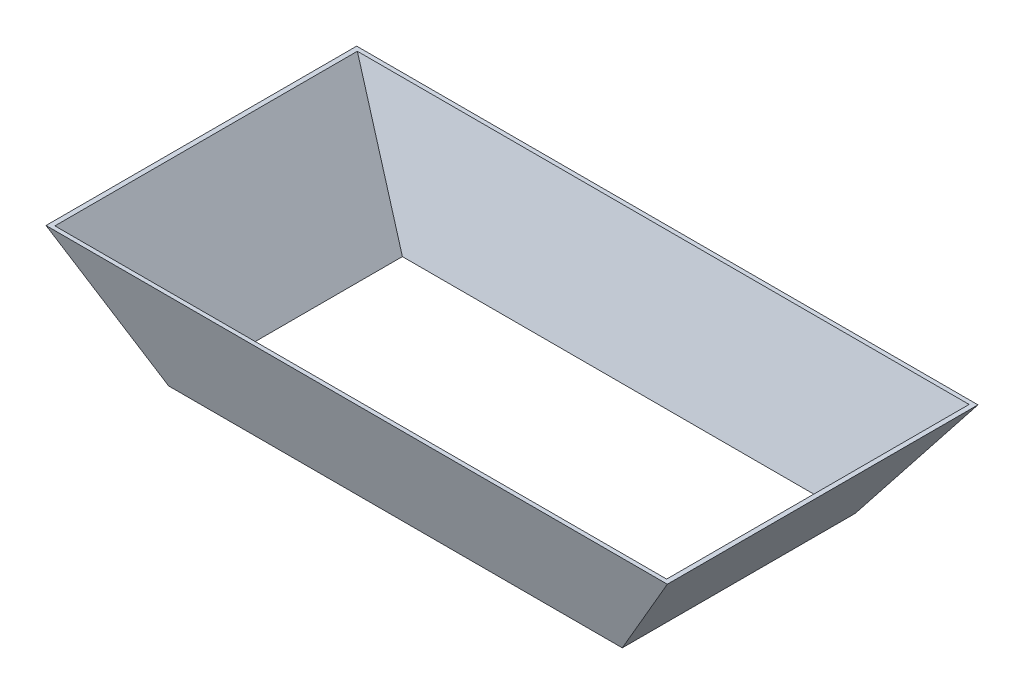
ISO-10303-21;
HEADER;
FILE_DESCRIPTION(('STEP AP214'),'2;1');
FILE_NAME('part.step','',(''),(''),'','','');
FILE_SCHEMA(('AUTOMOTIVE_DESIGN { 1 0 10303 214 1 1 1 1 }'));
ENDSEC;
DATA;
#1=APPLICATION_CONTEXT('core data for automotive mechanical design processes');
#2=APPLICATION_PROTOCOL_DEFINITION('international standard','automotive_design',2000,#1);
#3=PRODUCT_CONTEXT('',#1,'mechanical');
#4=PRODUCT('Part','Part','',(#3));
#5=PRODUCT_RELATED_PRODUCT_CATEGORY('part','',(#4));
#6=PRODUCT_DEFINITION_FORMATION('','',#4);
#7=PRODUCT_DEFINITION_CONTEXT('part definition',#1,'design');
#8=PRODUCT_DEFINITION('design','',#6,#7);
#9=PRODUCT_DEFINITION_SHAPE('','',#8);
#10=(LENGTH_UNIT() NAMED_UNIT(*) SI_UNIT(.MILLI.,.METRE.));
#11=(NAMED_UNIT(*) PLANE_ANGLE_UNIT() SI_UNIT($,.RADIAN.));
#12=(NAMED_UNIT(*) SI_UNIT($,.STERADIAN.) SOLID_ANGLE_UNIT());
#13=UNCERTAINTY_MEASURE_WITH_UNIT(LENGTH_MEASURE(1.E-05),#10,'distance_accuracy_value','');
#14=(GEOMETRIC_REPRESENTATION_CONTEXT(3) GLOBAL_UNCERTAINTY_ASSIGNED_CONTEXT((#13)) GLOBAL_UNIT_ASSIGNED_CONTEXT((#10,
#11,#12)) REPRESENTATION_CONTEXT('',''));
#15=CARTESIAN_POINT('',(0.,0.,0.));
#16=DIRECTION('',(0.,0.,1.));
#17=DIRECTION('',(1.,0.,0.));
#18=AXIS2_PLACEMENT_3D('',#15,#16,#17);
#19=CARTESIAN_POINT('',(0.,0.,0.));
#20=DIRECTION('',(0.,-1.,0.));
#21=DIRECTION('',(0.,0.,-1.));
#22=AXIS2_PLACEMENT_3D('',#19,#20,#21);
#23=PLANE('',#22);
#24=DIRECTION('',(0.,0.,1.));
#25=VECTOR('',#24,1.);
#26=CARTESIAN_POINT('',(-292.,0.,-150.));
#27=LINE('',#26,#25);
#28=CARTESIAN_POINT('',(-292.,0.,-150.));
#29=VERTEX_POINT('',#28);
#30=CARTESIAN_POINT('',(-292.,0.,150.));
#31=VERTEX_POINT('',#30);
#32=EDGE_CURVE('E239',#29,#31,#27,.T.);
#33=ORIENTED_EDGE('',*,*,#32,.F.);
#34=DIRECTION('',(-1.,0.,0.));
#35=VECTOR('',#34,1.);
#36=CARTESIAN_POINT('',(292.,0.,-150.));
#37=LINE('',#36,#35);
#38=CARTESIAN_POINT('',(292.,0.,-150.));
#39=VERTEX_POINT('',#38);
#40=EDGE_CURVE('E12',#39,#29,#37,.T.);
#41=ORIENTED_EDGE('',*,*,#40,.F.);
#42=DIRECTION('',(0.,0.,-1.));
#43=VECTOR('',#42,1.);
#44=CARTESIAN_POINT('',(292.,0.,-150.));
#45=LINE('',#44,#43);
#46=CARTESIAN_POINT('',(292.,0.,150.));
#47=VERTEX_POINT('',#46);
#48=EDGE_CURVE('E64',#47,#39,#45,.T.);
#49=ORIENTED_EDGE('',*,*,#48,.F.);
#50=DIRECTION('',(1.,0.,0.));
#51=VECTOR('',#50,1.);
#52=CARTESIAN_POINT('',(292.,0.,150.));
#53=LINE('',#52,#51);
#54=EDGE_CURVE('E225',#31,#47,#53,.T.);
#55=ORIENTED_EDGE('',*,*,#54,.F.);
#56=EDGE_LOOP('',(#33,#41,#49,#55));
#57=FACE_BOUND('',#56,.T.);
#58=DIRECTION('',(-1.,0.,0.));
#59=VECTOR('',#58,1.);
#60=CARTESIAN_POINT('',(0.,0.,-144.729537233053));
#61=LINE('',#60,#59);
#62=CARTESIAN_POINT('',(285.8388312797,0.,-144.729537233053));
#63=VERTEX_POINT('',#62);
#64=CARTESIAN_POINT('',(-285.8388312797,0.,-144.729537233053));
#65=VERTEX_POINT('',#64);
#66=EDGE_CURVE('E126',#63,#65,#61,.T.);
#67=ORIENTED_EDGE('',*,*,#66,.T.);
#68=DIRECTION('',(0.,0.,1.));
#69=VECTOR('',#68,1.);
#70=CARTESIAN_POINT('',(-285.8388312797,0.,0.));
#71=LINE('',#70,#69);
#72=CARTESIAN_POINT('',(-285.8388312797,0.,144.729537233053));
#73=VERTEX_POINT('',#72);
#74=EDGE_CURVE('E137',#65,#73,#71,.T.);
#75=ORIENTED_EDGE('',*,*,#74,.T.);
#76=DIRECTION('',(1.,0.,0.));
#77=VECTOR('',#76,1.);
#78=CARTESIAN_POINT('',(0.,0.,144.729537233053));
#79=LINE('',#78,#77);
#80=CARTESIAN_POINT('',(285.8388312797,0.,144.729537233053));
#81=VERTEX_POINT('',#80);
#82=EDGE_CURVE('E142',#73,#81,#79,.T.);
#83=ORIENTED_EDGE('',*,*,#82,.T.);
#84=DIRECTION('',(0.,0.,-1.));
#85=VECTOR('',#84,1.);
#86=CARTESIAN_POINT('',(285.8388312797,0.,0.));
#87=LINE('',#86,#85);
#88=EDGE_CURVE('E145',#81,#63,#87,.T.);
#89=ORIENTED_EDGE('',*,*,#88,.T.);
#90=EDGE_LOOP('',(#67,#75,#83,#89));
#91=FACE_BOUND('',#90,.T.);
#92=ADVANCED_FACE('F53',(#57,#91),#23,.T.);
#93=CARTESIAN_POINT('',(0.,150.,0.));
#94=DIRECTION('',(0.,-1.,0.));
#95=DIRECTION('',(0.,0.,-1.));
#96=AXIS2_PLACEMENT_3D('',#93,#94,#95);
#97=PLANE('',#96);
#98=DIRECTION('',(0.,0.,1.));
#99=VECTOR('',#98,1.);
#100=CARTESIAN_POINT('',(-400.,150.,-200.));
#101=LINE('',#100,#99);
#102=CARTESIAN_POINT('',(-400.,150.,-200.));
#103=VERTEX_POINT('',#102);
#104=CARTESIAN_POINT('',(-400.,150.,200.));
#105=VERTEX_POINT('',#104);
#106=EDGE_CURVE('E147',#103,#105,#101,.T.);
#107=ORIENTED_EDGE('',*,*,#106,.T.);
#108=DIRECTION('',(1.,0.,0.));
#109=VECTOR('',#108,1.);
#110=CARTESIAN_POINT('',(400.,150.,200.));
#111=LINE('',#110,#109);
#112=CARTESIAN_POINT('',(400.,150.,200.));
#113=VERTEX_POINT('',#112);
#114=EDGE_CURVE('E152',#105,#113,#111,.T.);
#115=ORIENTED_EDGE('',*,*,#114,.T.);
#116=DIRECTION('',(0.,0.,-1.));
#117=VECTOR('',#116,1.);
#118=CARTESIAN_POINT('',(400.,150.,-200.));
#119=LINE('',#118,#117);
#120=CARTESIAN_POINT('',(400.,150.,-200.));
#121=VERTEX_POINT('',#120);
#122=EDGE_CURVE('E298',#113,#121,#119,.T.);
#123=ORIENTED_EDGE('',*,*,#122,.T.);
#124=DIRECTION('',(-1.,0.,0.));
#125=VECTOR('',#124,1.);
#126=CARTESIAN_POINT('',(400.,150.,-200.));
#127=LINE('',#126,#125);
#128=EDGE_CURVE('E174',#121,#103,#127,.T.);
#129=ORIENTED_EDGE('',*,*,#128,.T.);
#130=EDGE_LOOP('',(#107,#115,#123,#129));
#131=FACE_BOUND('',#130,.T.);
#132=DIRECTION('',(0.,0.,1.));
#133=VECTOR('',#132,1.);
#134=CARTESIAN_POINT('',(-393.8388312797,150.,0.));
#135=LINE('',#134,#133);
#136=CARTESIAN_POINT('',(-393.8388312797,150.,-194.729537233053));
#137=VERTEX_POINT('',#136);
#138=CARTESIAN_POINT('',(-393.8388312797,150.,194.729537233053));
#139=VERTEX_POINT('',#138);
#140=EDGE_CURVE('E159',#137,#139,#135,.T.);
#141=ORIENTED_EDGE('',*,*,#140,.F.);
#142=DIRECTION('',(-1.,0.,0.));
#143=VECTOR('',#142,1.);
#144=CARTESIAN_POINT('',(0.,150.,-194.729537233053));
#145=LINE('',#144,#143);
#146=CARTESIAN_POINT('',(393.8388312797,150.,-194.729537233053));
#147=VERTEX_POINT('',#146);
#148=EDGE_CURVE('E128',#147,#137,#145,.T.);
#149=ORIENTED_EDGE('',*,*,#148,.F.);
#150=DIRECTION('',(0.,0.,-1.));
#151=VECTOR('',#150,1.);
#152=CARTESIAN_POINT('',(393.8388312797,150.,0.));
#153=LINE('',#152,#151);
#154=CARTESIAN_POINT('',(393.8388312797,150.,194.729537233053));
#155=VERTEX_POINT('',#154);
#156=EDGE_CURVE('E79',#155,#147,#153,.T.);
#157=ORIENTED_EDGE('',*,*,#156,.F.);
#158=DIRECTION('',(1.,0.,0.));
#159=VECTOR('',#158,1.);
#160=CARTESIAN_POINT('',(0.,150.,194.729537233053));
#161=LINE('',#160,#159);
#162=EDGE_CURVE('E162',#139,#155,#161,.T.);
#163=ORIENTED_EDGE('',*,*,#162,.F.);
#164=EDGE_LOOP('',(#141,#149,#157,#163));
#165=FACE_BOUND('',#164,.T.);
#166=ADVANCED_FACE('F254',(#131,#165),#97,.F.);
#167=CARTESIAN_POINT('',(-192.307692307692,-138.461538461538,0.));
#168=DIRECTION('',(-0.811534341451495,-0.584304725845076,0.));
#169=DIRECTION('',(0.584304725845076,-0.811534341451495,0.));
#170=AXIS2_PLACEMENT_3D('',#167,#168,#169);
#171=PLANE('',#170);
#172=DIRECTION('',(0.564032115928149,-0.783377938789096,0.261125979596366));
#173=VECTOR('',#172,1.);
#174=CARTESIAN_POINT('',(-400.,150.,-200.));
#175=LINE('',#174,#173);
#176=EDGE_CURVE('E273',#103,#29,#175,.T.);
#177=ORIENTED_EDGE('',*,*,#176,.T.);
#178=ORIENTED_EDGE('',*,*,#32,.T.);
#179=DIRECTION('',(0.564032115928149,-0.783377938789096,-0.261125979596366));
#180=VECTOR('',#179,1.);
#181=CARTESIAN_POINT('',(-400.,150.,200.));
#182=LINE('',#181,#180);
#183=EDGE_CURVE('E270',#105,#31,#182,.T.);
#184=ORIENTED_EDGE('',*,*,#183,.F.);
#185=ORIENTED_EDGE('',*,*,#106,.F.);
#186=EDGE_LOOP('',(#177,#178,#184,#185));
#187=FACE_BOUND('',#186,.T.);
#188=ADVANCED_FACE('F245',(#187),#171,.T.);
#189=CARTESIAN_POINT('',(0.,-45.,135.));
#190=DIRECTION('',(0.,0.316227766016838,-0.948683298050514));
#191=DIRECTION('',(0.,0.948683298050514,0.316227766016838));
#192=AXIS2_PLACEMENT_3D('',#189,#190,#191);
#193=PLANE('',#192);
#194=ORIENTED_EDGE('',*,*,#183,.T.);
#195=ORIENTED_EDGE('',*,*,#54,.T.);
#196=DIRECTION('',(-0.56403211592815,-0.783377938789096,-0.261125979596365));
#197=VECTOR('',#196,1.);
#198=CARTESIAN_POINT('',(400.,150.,200.));
#199=LINE('',#198,#197);
#200=EDGE_CURVE('E286',#113,#47,#199,.T.);
#201=ORIENTED_EDGE('',*,*,#200,.F.);
#202=ORIENTED_EDGE('',*,*,#114,.F.);
#203=EDGE_LOOP('',(#194,#195,#201,#202));
#204=FACE_BOUND('',#203,.T.);
#205=ADVANCED_FACE('F192',(#204),#193,.F.);
#206=CARTESIAN_POINT('',(0.,-45.,-135.));
#207=DIRECTION('',(0.,0.316227766016838,0.948683298050514));
#208=DIRECTION('',(0.,-0.948683298050514,0.316227766016838));
#209=AXIS2_PLACEMENT_3D('',#206,#207,#208);
#210=PLANE('',#209);
#211=DIRECTION('',(-0.56403211592815,-0.783377938789096,0.261125979596366));
#212=VECTOR('',#211,1.);
#213=CARTESIAN_POINT('',(400.,150.,-200.));
#214=LINE('',#213,#212);
#215=EDGE_CURVE('E180',#121,#39,#214,.T.);
#216=ORIENTED_EDGE('',*,*,#215,.T.);
#217=ORIENTED_EDGE('',*,*,#40,.T.);
#218=ORIENTED_EDGE('',*,*,#176,.F.);
#219=ORIENTED_EDGE('',*,*,#128,.F.);
#220=EDGE_LOOP('',(#216,#217,#218,#219));
#221=FACE_BOUND('',#220,.T.);
#222=ADVANCED_FACE('F182',(#221),#210,.F.);
#223=CARTESIAN_POINT('',(192.307692307692,-138.461538461539,0.));
#224=DIRECTION('',(0.811534341451494,-0.584304725845077,0.));
#225=DIRECTION('',(0.584304725845076,0.811534341451494,0.));
#226=AXIS2_PLACEMENT_3D('',#223,#224,#225);
#227=PLANE('',#226);
#228=ORIENTED_EDGE('',*,*,#200,.T.);
#229=ORIENTED_EDGE('',*,*,#48,.T.);
#230=ORIENTED_EDGE('',*,*,#215,.F.);
#231=ORIENTED_EDGE('',*,*,#122,.F.);
#232=EDGE_LOOP('',(#228,#229,#230,#231));
#233=FACE_BOUND('',#232,.T.);
#234=ADVANCED_FACE('F191',(#233),#227,.T.);
#235=CARTESIAN_POINT('',(-188.250020600435,-135.540014832313,0.));
#236=DIRECTION('',(-0.811534341451495,-0.584304725845076,0.));
#237=DIRECTION('',(0.584304725845076,-0.811534341451495,0.));
#238=AXIS2_PLACEMENT_3D('',#235,#236,#237);
#239=PLANE('',#238);
#240=DIRECTION('',(0.564032115928149,-0.783377938789096,0.261125979596366));
#241=VECTOR('',#240,1.);
#242=CARTESIAN_POINT('',(-173.58802315443,-155.903900173987,-92.7615705083905));
#243=LINE('',#242,#241);
#244=EDGE_CURVE('E122',#137,#65,#243,.T.);
#245=ORIENTED_EDGE('',*,*,#244,.F.);
#246=ORIENTED_EDGE('',*,*,#140,.T.);
#247=DIRECTION('',(0.564032115928149,-0.783377938789096,-0.261125979596366));
#248=VECTOR('',#247,1.);
#249=CARTESIAN_POINT('',(-173.58802315443,-155.903900173986,92.7615705083906));
#250=LINE('',#249,#248);
#251=EDGE_CURVE('E133',#139,#73,#250,.T.);
#252=ORIENTED_EDGE('',*,*,#251,.T.);
#253=ORIENTED_EDGE('',*,*,#74,.F.);
#254=EDGE_LOOP('',(#245,#246,#252,#253));
#255=FACE_BOUND('',#254,.T.);
#256=ADVANCED_FACE('F138',(#255),#239,.F.);
#257=CARTESIAN_POINT('',(0.,-43.4188611699158,130.256583509747));
#258=DIRECTION('',(0.,0.316227766016838,-0.948683298050514));
#259=DIRECTION('',(0.,0.948683298050514,0.316227766016838));
#260=AXIS2_PLACEMENT_3D('',#257,#258,#259);
#261=PLANE('',#260);
#262=ORIENTED_EDGE('',*,*,#251,.F.);
#263=ORIENTED_EDGE('',*,*,#162,.T.);
#264=DIRECTION('',(-0.56403211592815,-0.783377938789096,-0.261125979596365));
#265=VECTOR('',#264,1.);
#266=CARTESIAN_POINT('',(173.58802315443,-155.903900173987,92.7615705083905));
#267=LINE('',#266,#265);
#268=EDGE_CURVE('E72',#155,#81,#267,.T.);
#269=ORIENTED_EDGE('',*,*,#268,.T.);
#270=ORIENTED_EDGE('',*,*,#82,.F.);
#271=EDGE_LOOP('',(#262,#263,#269,#270));
#272=FACE_BOUND('',#271,.T.);
#273=ADVANCED_FACE('F380',(#272),#261,.T.);
#274=CARTESIAN_POINT('',(0.,-43.4188611699159,-130.256583509747));
#275=DIRECTION('',(0.,0.316227766016838,0.948683298050514));
#276=DIRECTION('',(0.,-0.948683298050514,0.316227766016838));
#277=AXIS2_PLACEMENT_3D('',#274,#275,#276);
#278=PLANE('',#277);
#279=DIRECTION('',(-0.56403211592815,-0.783377938789096,0.261125979596366));
#280=VECTOR('',#279,1.);
#281=CARTESIAN_POINT('',(173.58802315443,-155.903900173987,-92.7615705083906));
#282=LINE('',#281,#280);
#283=EDGE_CURVE('E391',#147,#63,#282,.T.);
#284=ORIENTED_EDGE('',*,*,#283,.F.);
#285=ORIENTED_EDGE('',*,*,#148,.T.);
#286=ORIENTED_EDGE('',*,*,#244,.T.);
#287=ORIENTED_EDGE('',*,*,#66,.F.);
#288=EDGE_LOOP('',(#284,#285,#286,#287));
#289=FACE_BOUND('',#288,.T.);
#290=ADVANCED_FACE('F124',(#289),#278,.T.);
#291=CARTESIAN_POINT('',(188.250020600435,-135.540014832313,0.));
#292=DIRECTION('',(0.811534341451494,-0.584304725845077,0.));
#293=DIRECTION('',(0.584304725845076,0.811534341451494,0.));
#294=AXIS2_PLACEMENT_3D('',#291,#292,#293);
#295=PLANE('',#294);
#296=ORIENTED_EDGE('',*,*,#268,.F.);
#297=ORIENTED_EDGE('',*,*,#156,.T.);
#298=ORIENTED_EDGE('',*,*,#283,.T.);
#299=ORIENTED_EDGE('',*,*,#88,.F.);
#300=EDGE_LOOP('',(#296,#297,#298,#299));
#301=FACE_BOUND('',#300,.T.);
#302=ADVANCED_FACE('F396',(#301),#295,.F.);
#303=CLOSED_SHELL('',(#92,#166,#188,#205,#222,#234,#256,#273,#290,#302));
#304=MANIFOLD_SOLID_BREP('B2',#303);
#305=ADVANCED_BREP_SHAPE_REPRESENTATION('',(#18,#304),#14);
#306=SHAPE_DEFINITION_REPRESENTATION(#9,#305);
ENDSEC;
END-ISO-10303-21;
